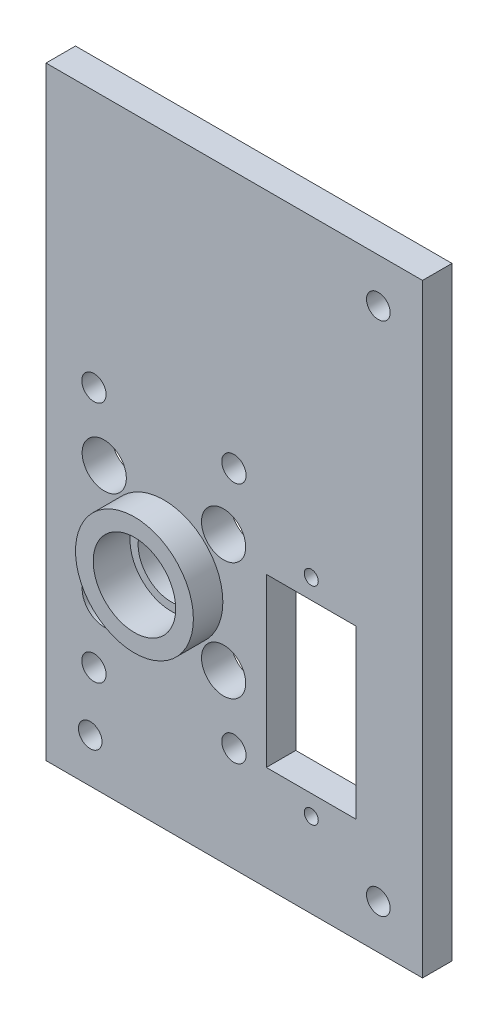
ISO-10303-21;
HEADER;
FILE_DESCRIPTION(('STEP AP214'),'2;1');
FILE_NAME('part.step','',(''),(''),'','','');
FILE_SCHEMA(('AUTOMOTIVE_DESIGN { 1 0 10303 214 1 1 1 1 }'));
ENDSEC;
DATA;
#1=APPLICATION_CONTEXT('core data for automotive mechanical design processes');
#2=APPLICATION_PROTOCOL_DEFINITION('international standard','automotive_design',2000,#1);
#3=PRODUCT_CONTEXT('',#1,'mechanical');
#4=PRODUCT('Part','Part','',(#3));
#5=PRODUCT_RELATED_PRODUCT_CATEGORY('part','',(#4));
#6=PRODUCT_DEFINITION_FORMATION('','',#4);
#7=PRODUCT_DEFINITION_CONTEXT('part definition',#1,'design');
#8=PRODUCT_DEFINITION('design','',#6,#7);
#9=PRODUCT_DEFINITION_SHAPE('','',#8);
#10=(LENGTH_UNIT() NAMED_UNIT(*) SI_UNIT(.MILLI.,.METRE.));
#11=(NAMED_UNIT(*) PLANE_ANGLE_UNIT() SI_UNIT($,.RADIAN.));
#12=(NAMED_UNIT(*) SI_UNIT($,.STERADIAN.) SOLID_ANGLE_UNIT());
#13=UNCERTAINTY_MEASURE_WITH_UNIT(LENGTH_MEASURE(1.E-05),#10,'distance_accuracy_value','');
#14=(GEOMETRIC_REPRESENTATION_CONTEXT(3) GLOBAL_UNCERTAINTY_ASSIGNED_CONTEXT((#13)) GLOBAL_UNIT_ASSIGNED_CONTEXT((#10,
#11,#12)) REPRESENTATION_CONTEXT('',''));
#15=CARTESIAN_POINT('',(0.,0.,0.));
#16=DIRECTION('',(0.,0.,1.));
#17=DIRECTION('',(1.,0.,0.));
#18=AXIS2_PLACEMENT_3D('',#15,#16,#17);
#19=CARTESIAN_POINT('',(-20.,0.,4.));
#20=DIRECTION('',(0.,0.,-1.));
#21=DIRECTION('',(-1.,0.,0.));
#22=AXIS2_PLACEMENT_3D('',#19,#20,#21);
#23=CYLINDRICAL_SURFACE('',#22,4.5);
#24=CARTESIAN_POINT('',(-20.,0.,0.));
#25=DIRECTION('',(0.,0.,1.));
#26=DIRECTION('',(1.,0.,0.));
#27=AXIS2_PLACEMENT_3D('',#24,#25,#26);
#28=CIRCLE('',#27,4.5);
#29=CARTESIAN_POINT('',(-15.5,0.,0.));
#30=VERTEX_POINT('',#29);
#31=EDGE_CURVE('E258',#30,#30,#28,.T.);
#32=ORIENTED_EDGE('',*,*,#31,.F.);
#33=EDGE_LOOP('',(#32));
#34=FACE_BOUND('',#33,.T.);
#35=CARTESIAN_POINT('',(-20.,0.,3.));
#36=DIRECTION('',(0.,0.,1.));
#37=DIRECTION('',(1.,0.,0.));
#38=AXIS2_PLACEMENT_3D('',#35,#36,#37);
#39=CIRCLE('',#38,4.5);
#40=CARTESIAN_POINT('',(-15.5,0.,3.));
#41=VERTEX_POINT('',#40);
#42=EDGE_CURVE('E250',#41,#41,#39,.T.);
#43=ORIENTED_EDGE('',*,*,#42,.T.);
#44=EDGE_LOOP('',(#43));
#45=FACE_BOUND('',#44,.T.);
#46=ADVANCED_FACE('F69',(#34,#45),#23,.F.);
#47=CARTESIAN_POINT('',(0.,0.,4.));
#48=DIRECTION('',(0.,0.,1.));
#49=DIRECTION('',(1.,0.,0.));
#50=AXIS2_PLACEMENT_3D('',#47,#48,#49);
#51=PLANE('',#50);
#52=CARTESIAN_POINT('',(9.1,45.35,4.));
#53=DIRECTION('',(0.,0.,1.));
#54=DIRECTION('',(1.,0.,0.));
#55=AXIS2_PLACEMENT_3D('',#52,#53,#54);
#56=CIRCLE('',#55,1.6);
#57=CARTESIAN_POINT('',(10.7,45.35,4.));
#58=VERTEX_POINT('',#57);
#59=EDGE_CURVE('E188',#58,#58,#56,.F.);
#60=ORIENTED_EDGE('',*,*,#59,.T.);
#61=EDGE_LOOP('',(#60));
#62=FACE_BOUND('',#61,.T.);
#63=CARTESIAN_POINT('',(-30.0036952079743,-24.65,4.));
#64=DIRECTION('',(0.,0.,1.));
#65=DIRECTION('',(1.,0.,0.));
#66=AXIS2_PLACEMENT_3D('',#63,#64,#65);
#67=CIRCLE('',#66,1.6);
#68=CARTESIAN_POINT('',(-28.4036952079743,-24.65,4.));
#69=VERTEX_POINT('',#68);
#70=EDGE_CURVE('E465',#69,#69,#67,.F.);
#71=ORIENTED_EDGE('',*,*,#70,.T.);
#72=EDGE_LOOP('',(#71));
#73=FACE_BOUND('',#72,.T.);
#74=CARTESIAN_POINT('',(9.1,-24.65,4.));
#75=DIRECTION('',(0.,0.,1.));
#76=DIRECTION('',(1.,0.,0.));
#77=AXIS2_PLACEMENT_3D('',#74,#75,#76);
#78=CIRCLE('',#77,1.6);
#79=CARTESIAN_POINT('',(10.7,-24.65,4.));
#80=VERTEX_POINT('',#79);
#81=EDGE_CURVE('E477',#80,#80,#78,.F.);
#82=ORIENTED_EDGE('',*,*,#81,.T.);
#83=EDGE_LOOP('',(#82));
#84=FACE_BOUND('',#83,.T.);
#85=CARTESIAN_POINT('',(-28.1,8.,4.));
#86=DIRECTION('',(0.,0.,1.));
#87=DIRECTION('',(1.,0.,0.));
#88=AXIS2_PLACEMENT_3D('',#85,#86,#87);
#89=CIRCLE('',#88,3.);
#90=CARTESIAN_POINT('',(-25.1,8.,4.));
#91=VERTEX_POINT('',#90);
#92=EDGE_CURVE('E217',#91,#91,#89,.F.);
#93=ORIENTED_EDGE('',*,*,#92,.T.);
#94=EDGE_LOOP('',(#93));
#95=FACE_BOUND('',#94,.T.);
#96=CARTESIAN_POINT('',(-11.9,-8.,4.));
#97=DIRECTION('',(0.,0.,1.));
#98=DIRECTION('',(1.,0.,0.));
#99=AXIS2_PLACEMENT_3D('',#96,#97,#98);
#100=CIRCLE('',#99,3.);
#101=CARTESIAN_POINT('',(-8.9,-8.,4.));
#102=VERTEX_POINT('',#101);
#103=EDGE_CURVE('E213',#102,#102,#100,.F.);
#104=ORIENTED_EDGE('',*,*,#103,.T.);
#105=EDGE_LOOP('',(#104));
#106=FACE_BOUND('',#105,.T.);
#107=CARTESIAN_POINT('',(-28.1,-8.,4.));
#108=DIRECTION('',(0.,0.,1.));
#109=DIRECTION('',(1.,0.,0.));
#110=AXIS2_PLACEMENT_3D('',#107,#108,#109);
#111=CIRCLE('',#110,3.);
#112=CARTESIAN_POINT('',(-25.1,-8.,4.));
#113=VERTEX_POINT('',#112);
#114=EDGE_CURVE('E209',#113,#113,#111,.F.);
#115=ORIENTED_EDGE('',*,*,#114,.T.);
#116=EDGE_LOOP('',(#115));
#117=FACE_BOUND('',#116,.T.);
#118=CARTESIAN_POINT('',(-11.9,8.,4.));
#119=DIRECTION('',(0.,0.,1.));
#120=DIRECTION('',(1.,0.,0.));
#121=AXIS2_PLACEMENT_3D('',#118,#119,#120);
#122=CIRCLE('',#121,3.);
#123=CARTESIAN_POINT('',(-8.9,8.,4.));
#124=VERTEX_POINT('',#123);
#125=EDGE_CURVE('E205',#124,#124,#122,.F.);
#126=ORIENTED_EDGE('',*,*,#125,.T.);
#127=EDGE_LOOP('',(#126));
#128=FACE_BOUND('',#127,.T.);
#129=CARTESIAN_POINT('',(-10.5,-16.4544826719043,4.));
#130=DIRECTION('',(0.,0.,1.));
#131=DIRECTION('',(1.,0.,0.));
#132=AXIS2_PLACEMENT_3D('',#129,#130,#131);
#133=CIRCLE('',#132,1.65);
#134=CARTESIAN_POINT('',(-8.84999999999998,-16.4544826719043,4.));
#135=VERTEX_POINT('',#134);
#136=EDGE_CURVE('E236',#135,#135,#133,.F.);
#137=ORIENTED_EDGE('',*,*,#136,.T.);
#138=EDGE_LOOP('',(#137));
#139=FACE_BOUND('',#138,.T.);
#140=CARTESIAN_POINT('',(-29.5,-16.4544826719043,4.));
#141=DIRECTION('',(0.,0.,1.));
#142=DIRECTION('',(1.,0.,0.));
#143=AXIS2_PLACEMENT_3D('',#140,#141,#142);
#144=CIRCLE('',#143,1.65);
#145=CARTESIAN_POINT('',(-27.85,-16.4544826719043,4.));
#146=VERTEX_POINT('',#145);
#147=EDGE_CURVE('E232',#146,#146,#144,.F.);
#148=ORIENTED_EDGE('',*,*,#147,.T.);
#149=EDGE_LOOP('',(#148));
#150=FACE_BOUND('',#149,.T.);
#151=CARTESIAN_POINT('',(-29.5,16.4544826719043,4.));
#152=DIRECTION('',(0.,0.,1.));
#153=DIRECTION('',(1.,0.,0.));
#154=AXIS2_PLACEMENT_3D('',#151,#152,#153);
#155=CIRCLE('',#154,1.65);
#156=CARTESIAN_POINT('',(-27.85,16.4544826719043,4.));
#157=VERTEX_POINT('',#156);
#158=EDGE_CURVE('E227',#157,#157,#155,.F.);
#159=ORIENTED_EDGE('',*,*,#158,.T.);
#160=EDGE_LOOP('',(#159));
#161=FACE_BOUND('',#160,.T.);
#162=CARTESIAN_POINT('',(-10.5,16.4544826719043,4.));
#163=DIRECTION('',(0.,0.,1.));
#164=DIRECTION('',(1.,0.,0.));
#165=AXIS2_PLACEMENT_3D('',#162,#163,#164);
#166=CIRCLE('',#165,1.65);
#167=CARTESIAN_POINT('',(-8.84999999999998,16.4544826719043,4.));
#168=VERTEX_POINT('',#167);
#169=EDGE_CURVE('E222',#168,#168,#166,.F.);
#170=ORIENTED_EDGE('',*,*,#169,.T.);
#171=EDGE_LOOP('',(#170));
#172=FACE_BOUND('',#171,.T.);
#173=CARTESIAN_POINT('',(-20.,0.,4.));
#174=DIRECTION('',(0.,0.,1.));
#175=DIRECTION('',(1.,0.,0.));
#176=AXIS2_PLACEMENT_3D('',#173,#174,#175);
#177=CIRCLE('',#176,8.);
#178=CARTESIAN_POINT('',(-12.,0.,4.));
#179=VERTEX_POINT('',#178);
#180=EDGE_CURVE('E259',#179,#179,#177,.T.);
#181=ORIENTED_EDGE('',*,*,#180,.F.);
#182=EDGE_LOOP('',(#181));
#183=FACE_BOUND('',#182,.T.);
#184=DIRECTION('',(-1.,0.,0.));
#185=VECTOR('',#184,1.);
#186=CARTESIAN_POINT('',(-6.1,6.2,4.));
#187=LINE('',#186,#185);
#188=CARTESIAN_POINT('',(6.1,6.2,4.));
#189=VERTEX_POINT('',#188);
#190=CARTESIAN_POINT('',(-6.1,6.2,4.));
#191=VERTEX_POINT('',#190);
#192=EDGE_CURVE('E269',#189,#191,#187,.T.);
#193=ORIENTED_EDGE('',*,*,#192,.F.);
#194=DIRECTION('',(0.,1.,0.));
#195=VECTOR('',#194,1.);
#196=CARTESIAN_POINT('',(6.1,-16.5,4.));
#197=LINE('',#196,#195);
#198=CARTESIAN_POINT('',(6.1,-16.5,4.));
#199=VERTEX_POINT('',#198);
#200=EDGE_CURVE('E266',#199,#189,#197,.T.);
#201=ORIENTED_EDGE('',*,*,#200,.F.);
#202=DIRECTION('',(1.,0.,0.));
#203=VECTOR('',#202,1.);
#204=CARTESIAN_POINT('',(-6.1,-16.5,4.));
#205=LINE('',#204,#203);
#206=CARTESIAN_POINT('',(-6.1,-16.5,4.));
#207=VERTEX_POINT('',#206);
#208=EDGE_CURVE('E276',#207,#199,#205,.T.);
#209=ORIENTED_EDGE('',*,*,#208,.F.);
#210=DIRECTION('',(0.,-1.,0.));
#211=VECTOR('',#210,1.);
#212=CARTESIAN_POINT('',(-6.1,6.2,4.));
#213=LINE('',#212,#211);
#214=EDGE_CURVE('E273',#191,#207,#213,.T.);
#215=ORIENTED_EDGE('',*,*,#214,.F.);
#216=EDGE_LOOP('',(#193,#201,#209,#215));
#217=FACE_BOUND('',#216,.T.);
#218=CARTESIAN_POINT('',(0.,-19.2,4.));
#219=DIRECTION('',(0.,0.,1.));
#220=DIRECTION('',(1.,0.,0.));
#221=AXIS2_PLACEMENT_3D('',#218,#219,#220);
#222=CIRCLE('',#221,0.95);
#223=CARTESIAN_POINT('',(0.95,-19.2,4.));
#224=VERTEX_POINT('',#223);
#225=EDGE_CURVE('E304',#224,#224,#222,.T.);
#226=ORIENTED_EDGE('',*,*,#225,.F.);
#227=EDGE_LOOP('',(#226));
#228=FACE_BOUND('',#227,.T.);
#229=DIRECTION('',(0.,1.,0.));
#230=VECTOR('',#229,1.);
#231=CARTESIAN_POINT('',(-36.0036952079743,0.,4.));
#232=LINE('',#231,#230);
#233=CARTESIAN_POINT('',(-36.0036952079743,-30.65,4.));
#234=VERTEX_POINT('',#233);
#235=CARTESIAN_POINT('',(-36.0036952079743,51.35,4.));
#236=VERTEX_POINT('',#235);
#237=EDGE_CURVE('E164',#234,#236,#232,.T.);
#238=ORIENTED_EDGE('',*,*,#237,.F.);
#239=DIRECTION('',(1.,0.,0.));
#240=VECTOR('',#239,1.);
#241=CARTESIAN_POINT('',(-36.0036952079743,-30.65,4.));
#242=LINE('',#241,#240);
#243=CARTESIAN_POINT('',(15.1,-30.65,4.));
#244=VERTEX_POINT('',#243);
#245=EDGE_CURVE('E156',#234,#244,#242,.T.);
#246=ORIENTED_EDGE('',*,*,#245,.T.);
#247=DIRECTION('',(0.,-1.,0.));
#248=VECTOR('',#247,1.);
#249=CARTESIAN_POINT('',(15.1,-21.65,4.));
#250=LINE('',#249,#248);
#251=CARTESIAN_POINT('',(15.1,51.35,4.));
#252=VERTEX_POINT('',#251);
#253=EDGE_CURVE('E138',#252,#244,#250,.T.);
#254=ORIENTED_EDGE('',*,*,#253,.F.);
#255=DIRECTION('',(1.,0.,0.));
#256=VECTOR('',#255,1.);
#257=CARTESIAN_POINT('',(-36.0036952079743,51.35,4.));
#258=LINE('',#257,#256);
#259=EDGE_CURVE('E185',#236,#252,#258,.T.);
#260=ORIENTED_EDGE('',*,*,#259,.F.);
#261=EDGE_LOOP('',(#238,#246,#254,#260));
#262=FACE_BOUND('',#261,.T.);
#263=CARTESIAN_POINT('',(0.,8.9,4.));
#264=DIRECTION('',(0.,0.,1.));
#265=DIRECTION('',(1.,0.,0.));
#266=AXIS2_PLACEMENT_3D('',#263,#264,#265);
#267=CIRCLE('',#266,0.95);
#268=CARTESIAN_POINT('',(0.95,8.9,4.));
#269=VERTEX_POINT('',#268);
#270=EDGE_CURVE('E12',#269,#269,#267,.T.);
#271=ORIENTED_EDGE('',*,*,#270,.F.);
#272=EDGE_LOOP('',(#271));
#273=FACE_BOUND('',#272,.T.);
#274=ADVANCED_FACE('F162',(#62,#73,#84,#95,#106,#117,#128,#139,#150,#161,#172,#183,#217,#228,
#262,#273),#51,.T.);
#275=CARTESIAN_POINT('',(0.,0.,0.));
#276=DIRECTION('',(0.,0.,1.));
#277=DIRECTION('',(1.,0.,0.));
#278=AXIS2_PLACEMENT_3D('',#275,#276,#277);
#279=PLANE('',#278);
#280=CARTESIAN_POINT('',(9.1,45.35,0.));
#281=DIRECTION('',(0.,0.,1.));
#282=DIRECTION('',(1.,0.,0.));
#283=AXIS2_PLACEMENT_3D('',#280,#281,#282);
#284=CIRCLE('',#283,1.6);
#285=CARTESIAN_POINT('',(10.7,45.35,0.));
#286=VERTEX_POINT('',#285);
#287=EDGE_CURVE('E472',#286,#286,#284,.T.);
#288=ORIENTED_EDGE('',*,*,#287,.T.);
#289=EDGE_LOOP('',(#288));
#290=FACE_BOUND('',#289,.T.);
#291=CARTESIAN_POINT('',(-30.0036952079743,-24.65,0.));
#292=DIRECTION('',(0.,0.,1.));
#293=DIRECTION('',(1.,0.,0.));
#294=AXIS2_PLACEMENT_3D('',#291,#292,#293);
#295=CIRCLE('',#294,1.6);
#296=CARTESIAN_POINT('',(-28.4036952079743,-24.65,0.));
#297=VERTEX_POINT('',#296);
#298=EDGE_CURVE('E468',#297,#297,#295,.T.);
#299=ORIENTED_EDGE('',*,*,#298,.T.);
#300=EDGE_LOOP('',(#299));
#301=FACE_BOUND('',#300,.T.);
#302=CARTESIAN_POINT('',(9.1,-24.65,0.));
#303=DIRECTION('',(0.,0.,1.));
#304=DIRECTION('',(1.,0.,0.));
#305=AXIS2_PLACEMENT_3D('',#302,#303,#304);
#306=CIRCLE('',#305,1.6);
#307=CARTESIAN_POINT('',(10.7,-24.65,0.));
#308=VERTEX_POINT('',#307);
#309=EDGE_CURVE('E471',#308,#308,#306,.T.);
#310=ORIENTED_EDGE('',*,*,#309,.T.);
#311=EDGE_LOOP('',(#310));
#312=FACE_BOUND('',#311,.T.);
#313=CARTESIAN_POINT('',(-28.1,8.,0.));
#314=DIRECTION('',(0.,0.,1.));
#315=DIRECTION('',(1.,0.,0.));
#316=AXIS2_PLACEMENT_3D('',#313,#314,#315);
#317=CIRCLE('',#316,3.);
#318=CARTESIAN_POINT('',(-25.1,8.,0.));
#319=VERTEX_POINT('',#318);
#320=EDGE_CURVE('E194',#319,#319,#317,.T.);
#321=ORIENTED_EDGE('',*,*,#320,.T.);
#322=EDGE_LOOP('',(#321));
#323=FACE_BOUND('',#322,.T.);
#324=CARTESIAN_POINT('',(-11.9,-8.,0.));
#325=DIRECTION('',(0.,0.,1.));
#326=DIRECTION('',(1.,0.,0.));
#327=AXIS2_PLACEMENT_3D('',#324,#325,#326);
#328=CIRCLE('',#327,3.);
#329=CARTESIAN_POINT('',(-8.9,-8.,0.));
#330=VERTEX_POINT('',#329);
#331=EDGE_CURVE('E172',#330,#330,#328,.T.);
#332=ORIENTED_EDGE('',*,*,#331,.T.);
#333=EDGE_LOOP('',(#332));
#334=FACE_BOUND('',#333,.T.);
#335=CARTESIAN_POINT('',(-28.1,-8.,0.));
#336=DIRECTION('',(0.,0.,1.));
#337=DIRECTION('',(1.,0.,0.));
#338=AXIS2_PLACEMENT_3D('',#335,#336,#337);
#339=CIRCLE('',#338,3.);
#340=CARTESIAN_POINT('',(-25.1,-8.,0.));
#341=VERTEX_POINT('',#340);
#342=EDGE_CURVE('E167',#341,#341,#339,.T.);
#343=ORIENTED_EDGE('',*,*,#342,.T.);
#344=EDGE_LOOP('',(#343));
#345=FACE_BOUND('',#344,.T.);
#346=CARTESIAN_POINT('',(-11.9,8.,0.));
#347=DIRECTION('',(0.,0.,1.));
#348=DIRECTION('',(1.,0.,0.));
#349=AXIS2_PLACEMENT_3D('',#346,#347,#348);
#350=CIRCLE('',#349,3.);
#351=CARTESIAN_POINT('',(-8.9,8.,0.));
#352=VERTEX_POINT('',#351);
#353=EDGE_CURVE('E198',#352,#352,#350,.T.);
#354=ORIENTED_EDGE('',*,*,#353,.T.);
#355=EDGE_LOOP('',(#354));
#356=FACE_BOUND('',#355,.T.);
#357=CARTESIAN_POINT('',(-10.5,-16.4544826719043,0.));
#358=DIRECTION('',(0.,0.,1.));
#359=DIRECTION('',(1.,0.,0.));
#360=AXIS2_PLACEMENT_3D('',#357,#358,#359);
#361=CIRCLE('',#360,1.65);
#362=CARTESIAN_POINT('',(-8.84999999999998,-16.4544826719043,0.));
#363=VERTEX_POINT('',#362);
#364=EDGE_CURVE('E73',#363,#363,#361,.F.);
#365=ORIENTED_EDGE('',*,*,#364,.F.);
#366=EDGE_LOOP('',(#365));
#367=FACE_BOUND('',#366,.T.);
#368=CARTESIAN_POINT('',(-29.5,-16.4544826719043,0.));
#369=DIRECTION('',(0.,0.,1.));
#370=DIRECTION('',(1.,0.,0.));
#371=AXIS2_PLACEMENT_3D('',#368,#369,#370);
#372=CIRCLE('',#371,1.65);
#373=CARTESIAN_POINT('',(-27.85,-16.4544826719043,0.));
#374=VERTEX_POINT('',#373);
#375=EDGE_CURVE('E231',#374,#374,#372,.F.);
#376=ORIENTED_EDGE('',*,*,#375,.F.);
#377=EDGE_LOOP('',(#376));
#378=FACE_BOUND('',#377,.T.);
#379=CARTESIAN_POINT('',(-29.5,16.4544826719043,0.));
#380=DIRECTION('',(0.,0.,1.));
#381=DIRECTION('',(1.,0.,0.));
#382=AXIS2_PLACEMENT_3D('',#379,#380,#381);
#383=CIRCLE('',#382,1.65);
#384=CARTESIAN_POINT('',(-27.85,16.4544826719043,0.));
#385=VERTEX_POINT('',#384);
#386=EDGE_CURVE('E226',#385,#385,#383,.F.);
#387=ORIENTED_EDGE('',*,*,#386,.F.);
#388=EDGE_LOOP('',(#387));
#389=FACE_BOUND('',#388,.T.);
#390=CARTESIAN_POINT('',(-10.5,16.4544826719043,0.));
#391=DIRECTION('',(0.,0.,1.));
#392=DIRECTION('',(1.,0.,0.));
#393=AXIS2_PLACEMENT_3D('',#390,#391,#392);
#394=CIRCLE('',#393,1.65);
#395=CARTESIAN_POINT('',(-8.84999999999998,16.4544826719043,0.));
#396=VERTEX_POINT('',#395);
#397=EDGE_CURVE('E221',#396,#396,#394,.F.);
#398=ORIENTED_EDGE('',*,*,#397,.F.);
#399=EDGE_LOOP('',(#398));
#400=FACE_BOUND('',#399,.T.);
#401=CARTESIAN_POINT('',(0.,-19.2,0.));
#402=DIRECTION('',(0.,0.,1.));
#403=DIRECTION('',(1.,0.,0.));
#404=AXIS2_PLACEMENT_3D('',#401,#402,#403);
#405=CIRCLE('',#404,0.95);
#406=CARTESIAN_POINT('',(0.95,-19.2,0.));
#407=VERTEX_POINT('',#406);
#408=EDGE_CURVE('E303',#407,#407,#405,.T.);
#409=ORIENTED_EDGE('',*,*,#408,.T.);
#410=EDGE_LOOP('',(#409));
#411=FACE_BOUND('',#410,.T.);
#412=CARTESIAN_POINT('',(0.,8.9,0.));
#413=DIRECTION('',(0.,0.,1.));
#414=DIRECTION('',(1.,0.,0.));
#415=AXIS2_PLACEMENT_3D('',#412,#413,#414);
#416=CIRCLE('',#415,0.95);
#417=CARTESIAN_POINT('',(0.95,8.9,0.));
#418=VERTEX_POINT('',#417);
#419=EDGE_CURVE('E79',#418,#418,#416,.T.);
#420=ORIENTED_EDGE('',*,*,#419,.T.);
#421=EDGE_LOOP('',(#420));
#422=FACE_BOUND('',#421,.T.);
#423=DIRECTION('',(0.,1.,0.));
#424=VECTOR('',#423,1.);
#425=CARTESIAN_POINT('',(-36.0036952079743,0.,0.));
#426=LINE('',#425,#424);
#427=CARTESIAN_POINT('',(-36.0036952079743,-30.65,0.));
#428=VERTEX_POINT('',#427);
#429=CARTESIAN_POINT('',(-36.0036952079743,51.35,0.));
#430=VERTEX_POINT('',#429);
#431=EDGE_CURVE('E240',#428,#430,#426,.T.);
#432=ORIENTED_EDGE('',*,*,#431,.T.);
#433=DIRECTION('',(1.,0.,0.));
#434=VECTOR('',#433,1.);
#435=CARTESIAN_POINT('',(-36.0036952079743,51.35,0.));
#436=LINE('',#435,#434);
#437=CARTESIAN_POINT('',(15.1,51.35,0.));
#438=VERTEX_POINT('',#437);
#439=EDGE_CURVE('E180',#430,#438,#436,.T.);
#440=ORIENTED_EDGE('',*,*,#439,.T.);
#441=DIRECTION('',(0.,-1.,0.));
#442=VECTOR('',#441,1.);
#443=CARTESIAN_POINT('',(15.1,-21.65,0.));
#444=LINE('',#443,#442);
#445=CARTESIAN_POINT('',(15.1,-30.65,0.));
#446=VERTEX_POINT('',#445);
#447=EDGE_CURVE('E160',#438,#446,#444,.T.);
#448=ORIENTED_EDGE('',*,*,#447,.T.);
#449=DIRECTION('',(1.,0.,0.));
#450=VECTOR('',#449,1.);
#451=CARTESIAN_POINT('',(-36.0036952079743,-30.65,0.));
#452=LINE('',#451,#450);
#453=EDGE_CURVE('E150',#428,#446,#452,.T.);
#454=ORIENTED_EDGE('',*,*,#453,.F.);
#455=EDGE_LOOP('',(#432,#440,#448,#454));
#456=FACE_BOUND('',#455,.T.);
#457=DIRECTION('',(0.,1.,0.));
#458=VECTOR('',#457,1.);
#459=CARTESIAN_POINT('',(6.1,-16.5,0.));
#460=LINE('',#459,#458);
#461=CARTESIAN_POINT('',(6.1,-16.5,0.));
#462=VERTEX_POINT('',#461);
#463=CARTESIAN_POINT('',(6.1,6.2,0.));
#464=VERTEX_POINT('',#463);
#465=EDGE_CURVE('E95',#462,#464,#460,.T.);
#466=ORIENTED_EDGE('',*,*,#465,.T.);
#467=DIRECTION('',(-1.,0.,0.));
#468=VECTOR('',#467,1.);
#469=CARTESIAN_POINT('',(-6.1,6.2,0.));
#470=LINE('',#469,#468);
#471=CARTESIAN_POINT('',(-6.1,6.2,0.));
#472=VERTEX_POINT('',#471);
#473=EDGE_CURVE('E282',#464,#472,#470,.T.);
#474=ORIENTED_EDGE('',*,*,#473,.T.);
#475=DIRECTION('',(0.,-1.,0.));
#476=VECTOR('',#475,1.);
#477=CARTESIAN_POINT('',(-6.1,6.2,0.));
#478=LINE('',#477,#476);
#479=CARTESIAN_POINT('',(-6.1,-16.5,0.));
#480=VERTEX_POINT('',#479);
#481=EDGE_CURVE('E286',#472,#480,#478,.T.);
#482=ORIENTED_EDGE('',*,*,#481,.T.);
#483=DIRECTION('',(1.,0.,0.));
#484=VECTOR('',#483,1.);
#485=CARTESIAN_POINT('',(-6.1,-16.5,0.));
#486=LINE('',#485,#484);
#487=EDGE_CURVE('E270',#480,#462,#486,.T.);
#488=ORIENTED_EDGE('',*,*,#487,.T.);
#489=EDGE_LOOP('',(#466,#474,#482,#488));
#490=FACE_BOUND('',#489,.T.);
#491=ORIENTED_EDGE('',*,*,#31,.T.);
#492=EDGE_LOOP('',(#491));
#493=FACE_BOUND('',#492,.T.);
#494=ADVANCED_FACE('F71',(#290,#301,#312,#323,#334,#345,#356,#367,#378,#389,#400,#411,#422,#456,
#490,#493),#279,.F.);
#495=CARTESIAN_POINT('',(0.,8.9,4.));
#496=DIRECTION('',(0.,0.,-1.));
#497=DIRECTION('',(-1.,0.,0.));
#498=AXIS2_PLACEMENT_3D('',#495,#496,#497);
#499=CYLINDRICAL_SURFACE('',#498,0.95);
#500=ORIENTED_EDGE('',*,*,#270,.T.);
#501=EDGE_LOOP('',(#500));
#502=FACE_BOUND('',#501,.T.);
#503=ORIENTED_EDGE('',*,*,#419,.F.);
#504=EDGE_LOOP('',(#503));
#505=FACE_BOUND('',#504,.T.);
#506=ADVANCED_FACE('F330',(#502,#505),#499,.F.);
#507=CARTESIAN_POINT('',(0.,-19.2,4.));
#508=DIRECTION('',(0.,0.,-1.));
#509=DIRECTION('',(-1.,0.,0.));
#510=AXIS2_PLACEMENT_3D('',#507,#508,#509);
#511=CYLINDRICAL_SURFACE('',#510,0.95);
#512=ORIENTED_EDGE('',*,*,#225,.T.);
#513=EDGE_LOOP('',(#512));
#514=FACE_BOUND('',#513,.T.);
#515=ORIENTED_EDGE('',*,*,#408,.F.);
#516=EDGE_LOOP('',(#515));
#517=FACE_BOUND('',#516,.T.);
#518=ADVANCED_FACE('F384',(#514,#517),#511,.F.);
#519=CARTESIAN_POINT('',(6.1,-16.5,4.));
#520=DIRECTION('',(-1.,0.,0.));
#521=DIRECTION('',(0.,0.,1.));
#522=AXIS2_PLACEMENT_3D('',#519,#520,#521);
#523=PLANE('',#522);
#524=ORIENTED_EDGE('',*,*,#465,.F.);
#525=DIRECTION('',(0.,0.,-1.));
#526=VECTOR('',#525,1.);
#527=CARTESIAN_POINT('',(6.1,-16.5,4.));
#528=LINE('',#527,#526);
#529=EDGE_CURVE('E279',#199,#462,#528,.T.);
#530=ORIENTED_EDGE('',*,*,#529,.F.);
#531=ORIENTED_EDGE('',*,*,#200,.T.);
#532=DIRECTION('',(0.,0.,-1.));
#533=VECTOR('',#532,1.);
#534=CARTESIAN_POINT('',(6.1,6.2,4.));
#535=LINE('',#534,#533);
#536=EDGE_CURVE('E300',#189,#464,#535,.T.);
#537=ORIENTED_EDGE('',*,*,#536,.T.);
#538=EDGE_LOOP('',(#524,#530,#531,#537));
#539=FACE_BOUND('',#538,.T.);
#540=ADVANCED_FACE('F387',(#539),#523,.T.);
#541=CARTESIAN_POINT('',(-6.1,6.2,4.));
#542=DIRECTION('',(0.,-1.,0.));
#543=DIRECTION('',(1.,0.,0.));
#544=AXIS2_PLACEMENT_3D('',#541,#542,#543);
#545=PLANE('',#544);
#546=ORIENTED_EDGE('',*,*,#473,.F.);
#547=ORIENTED_EDGE('',*,*,#536,.F.);
#548=ORIENTED_EDGE('',*,*,#192,.T.);
#549=DIRECTION('',(0.,0.,-1.));
#550=VECTOR('',#549,1.);
#551=CARTESIAN_POINT('',(-6.1,6.2,4.));
#552=LINE('',#551,#550);
#553=EDGE_CURVE('E297',#191,#472,#552,.T.);
#554=ORIENTED_EDGE('',*,*,#553,.T.);
#555=EDGE_LOOP('',(#546,#547,#548,#554));
#556=FACE_BOUND('',#555,.T.);
#557=ADVANCED_FACE('F393',(#556),#545,.T.);
#558=CARTESIAN_POINT('',(-6.1,6.2,4.));
#559=DIRECTION('',(1.,0.,0.));
#560=DIRECTION('',(0.,0.,-1.));
#561=AXIS2_PLACEMENT_3D('',#558,#559,#560);
#562=PLANE('',#561);
#563=ORIENTED_EDGE('',*,*,#481,.F.);
#564=ORIENTED_EDGE('',*,*,#553,.F.);
#565=ORIENTED_EDGE('',*,*,#214,.T.);
#566=DIRECTION('',(0.,0.,-1.));
#567=VECTOR('',#566,1.);
#568=CARTESIAN_POINT('',(-6.1,-16.5,4.));
#569=LINE('',#568,#567);
#570=EDGE_CURVE('E87',#207,#480,#569,.T.);
#571=ORIENTED_EDGE('',*,*,#570,.T.);
#572=EDGE_LOOP('',(#563,#564,#565,#571));
#573=FACE_BOUND('',#572,.T.);
#574=ADVANCED_FACE('F400',(#573),#562,.T.);
#575=CARTESIAN_POINT('',(-6.1,-16.5,4.));
#576=DIRECTION('',(0.,1.,0.));
#577=DIRECTION('',(0.,0.,1.));
#578=AXIS2_PLACEMENT_3D('',#575,#576,#577);
#579=PLANE('',#578);
#580=ORIENTED_EDGE('',*,*,#487,.F.);
#581=ORIENTED_EDGE('',*,*,#570,.F.);
#582=ORIENTED_EDGE('',*,*,#208,.T.);
#583=ORIENTED_EDGE('',*,*,#529,.T.);
#584=EDGE_LOOP('',(#580,#581,#582,#583));
#585=FACE_BOUND('',#584,.T.);
#586=ADVANCED_FACE('F366',(#585),#579,.T.);
#587=CARTESIAN_POINT('',(-20.,0.,8.));
#588=DIRECTION('',(0.,0.,1.));
#589=DIRECTION('',(1.,0.,0.));
#590=AXIS2_PLACEMENT_3D('',#587,#588,#589);
#591=PLANE('',#590);
#592=CARTESIAN_POINT('',(-20.,0.,8.));
#593=DIRECTION('',(0.,0.,1.));
#594=DIRECTION('',(1.,0.,0.));
#595=AXIS2_PLACEMENT_3D('',#592,#593,#594);
#596=CIRCLE('',#595,5.6);
#597=CARTESIAN_POINT('',(-14.4,0.,8.));
#598=VERTEX_POINT('',#597);
#599=EDGE_CURVE('E243',#598,#598,#596,.T.);
#600=ORIENTED_EDGE('',*,*,#599,.F.);
#601=EDGE_LOOP('',(#600));
#602=FACE_BOUND('',#601,.T.);
#603=CARTESIAN_POINT('',(-20.,0.,8.));
#604=DIRECTION('',(0.,0.,1.));
#605=DIRECTION('',(1.,0.,0.));
#606=AXIS2_PLACEMENT_3D('',#603,#604,#605);
#607=CIRCLE('',#606,8.);
#608=CARTESIAN_POINT('',(-12.,0.,8.));
#609=VERTEX_POINT('',#608);
#610=EDGE_CURVE('E254',#609,#609,#607,.T.);
#611=ORIENTED_EDGE('',*,*,#610,.T.);
#612=EDGE_LOOP('',(#611));
#613=FACE_BOUND('',#612,.T.);
#614=ADVANCED_FACE('F363',(#602,#613),#591,.T.);
#615=CARTESIAN_POINT('',(-20.,0.,8.));
#616=DIRECTION('',(0.,0.,-1.));
#617=DIRECTION('',(-1.,0.,0.));
#618=AXIS2_PLACEMENT_3D('',#615,#616,#617);
#619=CYLINDRICAL_SURFACE('',#618,8.);
#620=ORIENTED_EDGE('',*,*,#610,.F.);
#621=EDGE_LOOP('',(#620));
#622=FACE_BOUND('',#621,.T.);
#623=ORIENTED_EDGE('',*,*,#180,.T.);
#624=EDGE_LOOP('',(#623));
#625=FACE_BOUND('',#624,.T.);
#626=ADVANCED_FACE('F359',(#622,#625),#619,.T.);
#627=CARTESIAN_POINT('',(-20.,0.,3.));
#628=DIRECTION('',(0.,0.,1.));
#629=DIRECTION('',(1.,0.,0.));
#630=AXIS2_PLACEMENT_3D('',#627,#628,#629);
#631=CYLINDRICAL_SURFACE('',#630,5.6);
#632=CARTESIAN_POINT('',(-20.,0.,3.));
#633=DIRECTION('',(0.,0.,1.));
#634=DIRECTION('',(1.,0.,0.));
#635=AXIS2_PLACEMENT_3D('',#632,#633,#634);
#636=CIRCLE('',#635,5.6);
#637=CARTESIAN_POINT('',(-14.4,0.,3.));
#638=VERTEX_POINT('',#637);
#639=EDGE_CURVE('E246',#638,#638,#636,.T.);
#640=ORIENTED_EDGE('',*,*,#639,.F.);
#641=EDGE_LOOP('',(#640));
#642=FACE_BOUND('',#641,.T.);
#643=ORIENTED_EDGE('',*,*,#599,.T.);
#644=EDGE_LOOP('',(#643));
#645=FACE_BOUND('',#644,.T.);
#646=ADVANCED_FACE('F353',(#642,#645),#631,.F.);
#647=CARTESIAN_POINT('',(-20.,0.,3.));
#648=DIRECTION('',(0.,0.,1.));
#649=DIRECTION('',(1.,0.,0.));
#650=AXIS2_PLACEMENT_3D('',#647,#648,#649);
#651=PLANE('',#650);
#652=ORIENTED_EDGE('',*,*,#42,.F.);
#653=EDGE_LOOP('',(#652));
#654=FACE_BOUND('',#653,.T.);
#655=ORIENTED_EDGE('',*,*,#639,.T.);
#656=EDGE_LOOP('',(#655));
#657=FACE_BOUND('',#656,.T.);
#658=ADVANCED_FACE('F349',(#654,#657),#651,.T.);
#659=CARTESIAN_POINT('',(-36.0036952079743,0.,66.3164771261489));
#660=DIRECTION('',(-1.,0.,0.));
#661=DIRECTION('',(0.,0.,1.));
#662=AXIS2_PLACEMENT_3D('',#659,#660,#661);
#663=PLANE('',#662);
#664=ORIENTED_EDGE('',*,*,#431,.F.);
#665=DIRECTION('',(0.,0.,-1.));
#666=VECTOR('',#665,1.);
#667=CARTESIAN_POINT('',(-36.0036952079743,-30.65,63.2586505407399));
#668=LINE('',#667,#666);
#669=EDGE_CURVE('E177',#234,#428,#668,.T.);
#670=ORIENTED_EDGE('',*,*,#669,.F.);
#671=ORIENTED_EDGE('',*,*,#237,.T.);
#672=DIRECTION('',(0.,0.,-1.));
#673=VECTOR('',#672,1.);
#674=CARTESIAN_POINT('',(-36.0036952079743,51.35,63.2586505407399));
#675=LINE('',#674,#673);
#676=EDGE_CURVE('E184',#236,#430,#675,.T.);
#677=ORIENTED_EDGE('',*,*,#676,.T.);
#678=EDGE_LOOP('',(#664,#670,#671,#677));
#679=FACE_BOUND('',#678,.T.);
#680=ADVANCED_FACE('F352',(#679),#663,.T.);
#681=CARTESIAN_POINT('',(-10.5,16.4544826719043,8.));
#682=DIRECTION('',(0.,0.,-1.));
#683=DIRECTION('',(-1.,0.,0.));
#684=AXIS2_PLACEMENT_3D('',#681,#682,#683);
#685=CYLINDRICAL_SURFACE('',#684,1.65);
#686=ORIENTED_EDGE('',*,*,#169,.F.);
#687=EDGE_LOOP('',(#686));
#688=FACE_BOUND('',#687,.T.);
#689=ORIENTED_EDGE('',*,*,#397,.T.);
#690=EDGE_LOOP('',(#689));
#691=FACE_BOUND('',#690,.T.);
#692=ADVANCED_FACE('F409',(#688,#691),#685,.F.);
#693=CARTESIAN_POINT('',(-29.5,16.4544826719043,8.));
#694=DIRECTION('',(0.,0.,-1.));
#695=DIRECTION('',(-1.,0.,0.));
#696=AXIS2_PLACEMENT_3D('',#693,#694,#695);
#697=CYLINDRICAL_SURFACE('',#696,1.65);
#698=ORIENTED_EDGE('',*,*,#158,.F.);
#699=EDGE_LOOP('',(#698));
#700=FACE_BOUND('',#699,.T.);
#701=ORIENTED_EDGE('',*,*,#386,.T.);
#702=EDGE_LOOP('',(#701));
#703=FACE_BOUND('',#702,.T.);
#704=ADVANCED_FACE('F413',(#700,#703),#697,.F.);
#705=CARTESIAN_POINT('',(-29.5,-16.4544826719043,8.));
#706=DIRECTION('',(0.,0.,-1.));
#707=DIRECTION('',(-1.,0.,0.));
#708=AXIS2_PLACEMENT_3D('',#705,#706,#707);
#709=CYLINDRICAL_SURFACE('',#708,1.65);
#710=ORIENTED_EDGE('',*,*,#147,.F.);
#711=EDGE_LOOP('',(#710));
#712=FACE_BOUND('',#711,.T.);
#713=ORIENTED_EDGE('',*,*,#375,.T.);
#714=EDGE_LOOP('',(#713));
#715=FACE_BOUND('',#714,.T.);
#716=ADVANCED_FACE('F326',(#712,#715),#709,.F.);
#717=CARTESIAN_POINT('',(-10.5,-16.4544826719043,8.));
#718=DIRECTION('',(0.,0.,-1.));
#719=DIRECTION('',(-1.,0.,0.));
#720=AXIS2_PLACEMENT_3D('',#717,#718,#719);
#721=CYLINDRICAL_SURFACE('',#720,1.65);
#722=ORIENTED_EDGE('',*,*,#136,.F.);
#723=EDGE_LOOP('',(#722));
#724=FACE_BOUND('',#723,.T.);
#725=ORIENTED_EDGE('',*,*,#364,.T.);
#726=EDGE_LOOP('',(#725));
#727=FACE_BOUND('',#726,.T.);
#728=ADVANCED_FACE('F415',(#724,#727),#721,.F.);
#729=CARTESIAN_POINT('',(-11.9,8.,10.));
#730=DIRECTION('',(0.,0.,-1.));
#731=DIRECTION('',(-1.,0.,0.));
#732=AXIS2_PLACEMENT_3D('',#729,#730,#731);
#733=CYLINDRICAL_SURFACE('',#732,3.);
#734=ORIENTED_EDGE('',*,*,#125,.F.);
#735=EDGE_LOOP('',(#734));
#736=FACE_BOUND('',#735,.T.);
#737=ORIENTED_EDGE('',*,*,#353,.F.);
#738=EDGE_LOOP('',(#737));
#739=FACE_BOUND('',#738,.T.);
#740=ADVANCED_FACE('F418',(#736,#739),#733,.F.);
#741=CARTESIAN_POINT('',(-28.1,-8.,10.));
#742=DIRECTION('',(0.,0.,-1.));
#743=DIRECTION('',(-1.,0.,0.));
#744=AXIS2_PLACEMENT_3D('',#741,#742,#743);
#745=CYLINDRICAL_SURFACE('',#744,3.);
#746=ORIENTED_EDGE('',*,*,#114,.F.);
#747=EDGE_LOOP('',(#746));
#748=FACE_BOUND('',#747,.T.);
#749=ORIENTED_EDGE('',*,*,#342,.F.);
#750=EDGE_LOOP('',(#749));
#751=FACE_BOUND('',#750,.T.);
#752=ADVANCED_FACE('F428',(#748,#751),#745,.F.);
#753=CARTESIAN_POINT('',(-11.9,-8.,10.));
#754=DIRECTION('',(0.,0.,-1.));
#755=DIRECTION('',(-1.,0.,0.));
#756=AXIS2_PLACEMENT_3D('',#753,#754,#755);
#757=CYLINDRICAL_SURFACE('',#756,3.);
#758=ORIENTED_EDGE('',*,*,#103,.F.);
#759=EDGE_LOOP('',(#758));
#760=FACE_BOUND('',#759,.T.);
#761=ORIENTED_EDGE('',*,*,#331,.F.);
#762=EDGE_LOOP('',(#761));
#763=FACE_BOUND('',#762,.T.);
#764=ADVANCED_FACE('F430',(#760,#763),#757,.F.);
#765=CARTESIAN_POINT('',(-28.1,8.,10.));
#766=DIRECTION('',(0.,0.,-1.));
#767=DIRECTION('',(-1.,0.,0.));
#768=AXIS2_PLACEMENT_3D('',#765,#766,#767);
#769=CYLINDRICAL_SURFACE('',#768,3.);
#770=ORIENTED_EDGE('',*,*,#92,.F.);
#771=EDGE_LOOP('',(#770));
#772=FACE_BOUND('',#771,.T.);
#773=ORIENTED_EDGE('',*,*,#320,.F.);
#774=EDGE_LOOP('',(#773));
#775=FACE_BOUND('',#774,.T.);
#776=ADVANCED_FACE('F433',(#772,#775),#769,.F.);
#777=CARTESIAN_POINT('',(15.1,-21.65,63.2586505407399));
#778=DIRECTION('',(1.,0.,0.));
#779=DIRECTION('',(0.,0.,-1.));
#780=AXIS2_PLACEMENT_3D('',#777,#778,#779);
#781=PLANE('',#780);
#782=ORIENTED_EDGE('',*,*,#447,.F.);
#783=DIRECTION('',(0.,0.,-1.));
#784=VECTOR('',#783,1.);
#785=CARTESIAN_POINT('',(15.1,51.35,63.2586505407399));
#786=LINE('',#785,#784);
#787=EDGE_CURVE('E144',#252,#438,#786,.T.);
#788=ORIENTED_EDGE('',*,*,#787,.F.);
#789=ORIENTED_EDGE('',*,*,#253,.T.);
#790=DIRECTION('',(0.,0.,-1.));
#791=VECTOR('',#790,1.);
#792=CARTESIAN_POINT('',(15.1,-30.65,63.2586505407399));
#793=LINE('',#792,#791);
#794=EDGE_CURVE('E141',#244,#446,#793,.T.);
#795=ORIENTED_EDGE('',*,*,#794,.T.);
#796=EDGE_LOOP('',(#782,#788,#789,#795));
#797=FACE_BOUND('',#796,.T.);
#798=ADVANCED_FACE('F140',(#797),#781,.T.);
#799=CARTESIAN_POINT('',(-36.0036952079743,-30.65,63.2586505407399));
#800=DIRECTION('',(0.,1.,0.));
#801=DIRECTION('',(0.,0.,1.));
#802=AXIS2_PLACEMENT_3D('',#799,#800,#801);
#803=PLANE('',#802);
#804=ORIENTED_EDGE('',*,*,#245,.F.);
#805=ORIENTED_EDGE('',*,*,#669,.T.);
#806=ORIENTED_EDGE('',*,*,#453,.T.);
#807=ORIENTED_EDGE('',*,*,#794,.F.);
#808=EDGE_LOOP('',(#804,#805,#806,#807));
#809=FACE_BOUND('',#808,.T.);
#810=ADVANCED_FACE('F154',(#809),#803,.F.);
#811=CARTESIAN_POINT('',(-36.0036952079743,51.35,63.2586505407399));
#812=DIRECTION('',(0.,1.,0.));
#813=DIRECTION('',(0.,0.,1.));
#814=AXIS2_PLACEMENT_3D('',#811,#812,#813);
#815=PLANE('',#814);
#816=ORIENTED_EDGE('',*,*,#676,.F.);
#817=ORIENTED_EDGE('',*,*,#259,.T.);
#818=ORIENTED_EDGE('',*,*,#787,.T.);
#819=ORIENTED_EDGE('',*,*,#439,.F.);
#820=EDGE_LOOP('',(#816,#817,#818,#819));
#821=FACE_BOUND('',#820,.T.);
#822=ADVANCED_FACE('F441',(#821),#815,.T.);
#823=CARTESIAN_POINT('',(9.1,-24.65,8.));
#824=DIRECTION('',(0.,0.,-1.));
#825=DIRECTION('',(-1.,0.,0.));
#826=AXIS2_PLACEMENT_3D('',#823,#824,#825);
#827=CYLINDRICAL_SURFACE('',#826,1.6);
#828=ORIENTED_EDGE('',*,*,#81,.F.);
#829=EDGE_LOOP('',(#828));
#830=FACE_BOUND('',#829,.T.);
#831=ORIENTED_EDGE('',*,*,#309,.F.);
#832=EDGE_LOOP('',(#831));
#833=FACE_BOUND('',#832,.T.);
#834=ADVANCED_FACE('F444',(#830,#833),#827,.F.);
#835=CARTESIAN_POINT('',(-30.0036952079743,-24.65,8.));
#836=DIRECTION('',(0.,0.,-1.));
#837=DIRECTION('',(-1.,0.,0.));
#838=AXIS2_PLACEMENT_3D('',#835,#836,#837);
#839=CYLINDRICAL_SURFACE('',#838,1.6);
#840=ORIENTED_EDGE('',*,*,#70,.F.);
#841=EDGE_LOOP('',(#840));
#842=FACE_BOUND('',#841,.T.);
#843=ORIENTED_EDGE('',*,*,#298,.F.);
#844=EDGE_LOOP('',(#843));
#845=FACE_BOUND('',#844,.T.);
#846=ADVANCED_FACE('F452',(#842,#845),#839,.F.);
#847=CARTESIAN_POINT('',(9.1,45.35,8.));
#848=DIRECTION('',(0.,0.,-1.));
#849=DIRECTION('',(-1.,0.,0.));
#850=AXIS2_PLACEMENT_3D('',#847,#848,#849);
#851=CYLINDRICAL_SURFACE('',#850,1.6);
#852=ORIENTED_EDGE('',*,*,#59,.F.);
#853=EDGE_LOOP('',(#852));
#854=FACE_BOUND('',#853,.T.);
#855=ORIENTED_EDGE('',*,*,#287,.F.);
#856=EDGE_LOOP('',(#855));
#857=FACE_BOUND('',#856,.T.);
#858=ADVANCED_FACE('F454',(#854,#857),#851,.F.);
#859=CLOSED_SHELL('',(#46,#274,#494,#506,#518,#540,#557,#574,#586,#614,#626,#646,#658,#680,#692,
#704,#716,#728,#740,#752,#764,#776,#798,#810,#822,#834,#846,#858));
#860=MANIFOLD_SOLID_BREP('B2',#859);
#861=ADVANCED_BREP_SHAPE_REPRESENTATION('',(#18,#860),#14);
#862=SHAPE_DEFINITION_REPRESENTATION(#9,#861);
ENDSEC;
END-ISO-10303-21;
